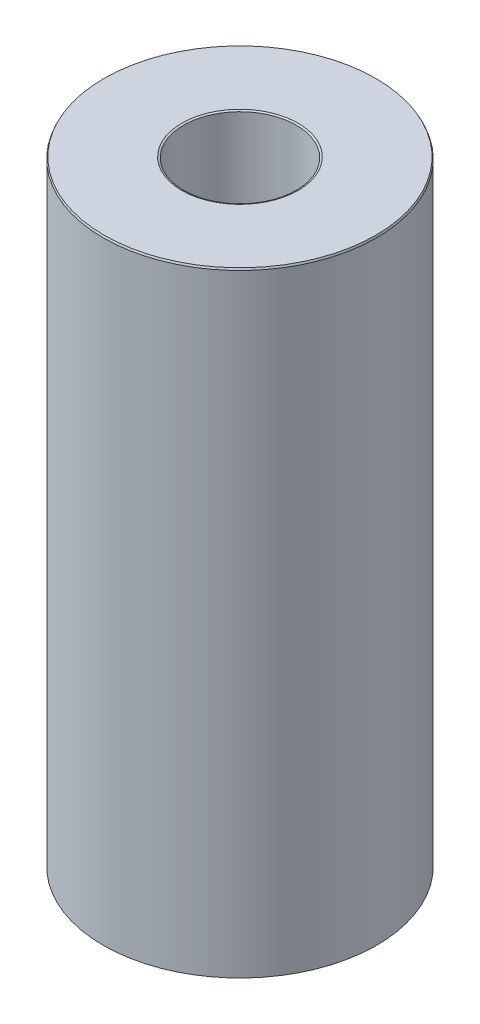
ISO-10303-21;
HEADER;
FILE_DESCRIPTION(('STEP AP214'),'2;1');
FILE_NAME('part.step','',(''),(''),'','','');
FILE_SCHEMA(('AUTOMOTIVE_DESIGN { 1 0 10303 214 1 1 1 1 }'));
ENDSEC;
DATA;
#1=APPLICATION_CONTEXT('core data for automotive mechanical design processes');
#2=APPLICATION_PROTOCOL_DEFINITION('international standard','automotive_design',2000,#1);
#3=PRODUCT_CONTEXT('',#1,'mechanical');
#4=PRODUCT('Part','Part','',(#3));
#5=PRODUCT_RELATED_PRODUCT_CATEGORY('part','',(#4));
#6=PRODUCT_DEFINITION_FORMATION('','',#4);
#7=PRODUCT_DEFINITION_CONTEXT('part definition',#1,'design');
#8=PRODUCT_DEFINITION('design','',#6,#7);
#9=PRODUCT_DEFINITION_SHAPE('','',#8);
#10=(LENGTH_UNIT() NAMED_UNIT(*) SI_UNIT(.MILLI.,.METRE.));
#11=(NAMED_UNIT(*) PLANE_ANGLE_UNIT() SI_UNIT($,.RADIAN.));
#12=(NAMED_UNIT(*) SI_UNIT($,.STERADIAN.) SOLID_ANGLE_UNIT());
#13=UNCERTAINTY_MEASURE_WITH_UNIT(LENGTH_MEASURE(1.E-05),#10,'distance_accuracy_value','');
#14=(GEOMETRIC_REPRESENTATION_CONTEXT(3) GLOBAL_UNCERTAINTY_ASSIGNED_CONTEXT((#13)) GLOBAL_UNIT_ASSIGNED_CONTEXT((#10,
#11,#12)) REPRESENTATION_CONTEXT('',''));
#15=CARTESIAN_POINT('',(0.,0.,0.));
#16=DIRECTION('',(0.,0.,1.));
#17=DIRECTION('',(1.,0.,0.));
#18=AXIS2_PLACEMENT_3D('',#15,#16,#17);
#19=CARTESIAN_POINT('',(0.,225.124120595034,0.));
#20=DIRECTION('',(0.,-1.,0.));
#21=DIRECTION('',(0.,0.,-1.));
#22=AXIS2_PLACEMENT_3D('',#19,#20,#21);
#23=CYLINDRICAL_SURFACE('',#22,50.);
#24=CARTESIAN_POINT('',(0.,0.297295181212298,0.));
#25=DIRECTION('',(0.,1.,0.));
#26=DIRECTION('',(0.,0.,1.));
#27=AXIS2_PLACEMENT_3D('',#24,#25,#26);
#28=CIRCLE('',#27,50.);
#29=CARTESIAN_POINT('',(0.,0.297295181212298,50.));
#30=VERTEX_POINT('',#29);
#31=EDGE_CURVE('E10',#30,#30,#28,.T.);
#32=ORIENTED_EDGE('',*,*,#31,.T.);
#33=EDGE_LOOP('',(#32));
#34=FACE_BOUND('',#33,.T.);
#35=CARTESIAN_POINT('',(0.,224.45630927449,0.));
#36=DIRECTION('',(0.,1.,0.));
#37=DIRECTION('',(0.,0.,1.));
#38=AXIS2_PLACEMENT_3D('',#35,#36,#37);
#39=CIRCLE('',#38,50.);
#40=CARTESIAN_POINT('',(0.,224.45630927449,50.));
#41=VERTEX_POINT('',#40);
#42=EDGE_CURVE('E50',#41,#41,#39,.F.);
#43=ORIENTED_EDGE('',*,*,#42,.T.);
#44=EDGE_LOOP('',(#43));
#45=FACE_BOUND('',#44,.T.);
#46=ADVANCED_FACE('F39',(#34,#45),#23,.T.);
#47=CARTESIAN_POINT('',(0.,225.124120595034,0.));
#48=DIRECTION('',(0.,1.,0.));
#49=DIRECTION('',(0.,0.,1.));
#50=AXIS2_PLACEMENT_3D('',#47,#48,#49);
#51=PLANE('',#50);
#52=CARTESIAN_POINT('',(0.,225.124120595034,0.));
#53=DIRECTION('',(0.,1.,0.));
#54=DIRECTION('',(0.,0.,1.));
#55=AXIS2_PLACEMENT_3D('',#52,#53,#54);
#56=CIRCLE('',#55,21.3043471888164);
#57=CARTESIAN_POINT('',(0.,225.124120595034,21.3043471888164));
#58=VERTEX_POINT('',#57);
#59=EDGE_CURVE('E58',#58,#58,#56,.F.);
#60=ORIENTED_EDGE('',*,*,#59,.T.);
#61=EDGE_LOOP('',(#60));
#62=FACE_BOUND('',#61,.T.);
#63=CARTESIAN_POINT('',(0.,225.124120595034,0.));
#64=DIRECTION('',(0.,1.,0.));
#65=DIRECTION('',(0.,0.,1.));
#66=AXIS2_PLACEMENT_3D('',#63,#64,#65);
#67=CIRCLE('',#66,49.7027048187878);
#68=CARTESIAN_POINT('',(0.,225.124120595034,49.7027048187878));
#69=VERTEX_POINT('',#68);
#70=EDGE_CURVE('E61',#69,#69,#67,.T.);
#71=ORIENTED_EDGE('',*,*,#70,.T.);
#72=EDGE_LOOP('',(#71));
#73=FACE_BOUND('',#72,.T.);
#74=ADVANCED_FACE('F88',(#62,#73),#51,.T.);
#75=CARTESIAN_POINT('',(0.,0.,0.));
#76=DIRECTION('',(0.,1.,0.));
#77=DIRECTION('',(0.,0.,1.));
#78=AXIS2_PLACEMENT_3D('',#75,#76,#77);
#79=PLANE('',#78);
#80=CARTESIAN_POINT('',(0.,0.,0.));
#81=DIRECTION('',(0.,1.,0.));
#82=DIRECTION('',(0.,0.,1.));
#83=AXIS2_PLACEMENT_3D('',#80,#81,#82);
#84=CIRCLE('',#83,20.9338310494844);
#85=CARTESIAN_POINT('',(0.,0.,20.9338310494844));
#86=VERTEX_POINT('',#85);
#87=EDGE_CURVE('E51',#86,#86,#84,.T.);
#88=ORIENTED_EDGE('',*,*,#87,.T.);
#89=EDGE_LOOP('',(#88));
#90=FACE_BOUND('',#89,.T.);
#91=CARTESIAN_POINT('',(0.,0.,0.));
#92=DIRECTION('',(0.,1.,0.));
#93=DIRECTION('',(0.,0.,1.));
#94=AXIS2_PLACEMENT_3D('',#91,#92,#93);
#95=CIRCLE('',#94,49.3321886794556);
#96=CARTESIAN_POINT('',(0.,0.,49.3321886794556));
#97=VERTEX_POINT('',#96);
#98=EDGE_CURVE('E54',#97,#97,#95,.F.);
#99=ORIENTED_EDGE('',*,*,#98,.T.);
#100=EDGE_LOOP('',(#99));
#101=FACE_BOUND('',#100,.T.);
#102=ADVANCED_FACE('F83',(#90,#101),#79,.F.);
#103=CARTESIAN_POINT('',(0.,225.124120595034,0.));
#104=DIRECTION('',(0.,-1.,0.));
#105=DIRECTION('',(0.,0.,-1.));
#106=AXIS2_PLACEMENT_3D('',#103,#104,#105);
#107=CYLINDRICAL_SURFACE('',#106,20.6365358682721);
#108=CARTESIAN_POINT('',(0.,224.826825413822,0.));
#109=DIRECTION('',(0.,1.,0.));
#110=DIRECTION('',(0.,0.,1.));
#111=AXIS2_PLACEMENT_3D('',#108,#109,#110);
#112=CIRCLE('',#111,20.6365358682721);
#113=CARTESIAN_POINT('',(0.,224.826825413822,20.6365358682721));
#114=VERTEX_POINT('',#113);
#115=EDGE_CURVE('E67',#114,#114,#112,.T.);
#116=ORIENTED_EDGE('',*,*,#115,.T.);
#117=EDGE_LOOP('',(#116));
#118=FACE_BOUND('',#117,.T.);
#119=CARTESIAN_POINT('',(0.,0.667811320544442,0.));
#120=DIRECTION('',(0.,1.,0.));
#121=DIRECTION('',(0.,0.,1.));
#122=AXIS2_PLACEMENT_3D('',#119,#120,#121);
#123=CIRCLE('',#122,20.6365358682721);
#124=CARTESIAN_POINT('',(0.,0.667811320544442,20.6365358682721));
#125=VERTEX_POINT('',#124);
#126=EDGE_CURVE('E69',#125,#125,#123,.F.);
#127=ORIENTED_EDGE('',*,*,#126,.T.);
#128=EDGE_LOOP('',(#127));
#129=FACE_BOUND('',#128,.T.);
#130=ADVANCED_FACE('F71',(#118,#129),#107,.F.);
#131=CARTESIAN_POINT('',(0.,224.826825413822,0.));
#132=DIRECTION('',(0.,1.,0.));
#133=DIRECTION('',(0.,0.,1.));
#134=AXIS2_PLACEMENT_3D('',#131,#132,#133);
#135=CONICAL_SURFACE('',#134,20.6365358682721,1.15195926593762);
#136=ORIENTED_EDGE('',*,*,#59,.F.);
#137=EDGE_LOOP('',(#136));
#138=FACE_BOUND('',#137,.T.);
#139=ORIENTED_EDGE('',*,*,#115,.F.);
#140=EDGE_LOOP('',(#139));
#141=FACE_BOUND('',#140,.T.);
#142=ADVANCED_FACE('F77',(#138,#141),#135,.F.);
#143=CARTESIAN_POINT('',(0.,0.,0.));
#144=DIRECTION('',(0.,-1.,0.));
#145=DIRECTION('',(0.,0.,-1.));
#146=AXIS2_PLACEMENT_3D('',#143,#144,#145);
#147=CONICAL_SURFACE('',#146,20.9338310494844,0.418837060857294);
#148=ORIENTED_EDGE('',*,*,#126,.F.);
#149=EDGE_LOOP('',(#148));
#150=FACE_BOUND('',#149,.T.);
#151=ORIENTED_EDGE('',*,*,#87,.F.);
#152=EDGE_LOOP('',(#151));
#153=FACE_BOUND('',#152,.T.);
#154=ADVANCED_FACE('F73',(#150,#153),#147,.F.);
#155=CARTESIAN_POINT('',(0.,0.297295181212298,0.));
#156=DIRECTION('',(0.,1.,0.));
#157=DIRECTION('',(0.,0.,1.));
#158=AXIS2_PLACEMENT_3D('',#155,#156,#157);
#159=CONICAL_SURFACE('',#158,50.,1.15195926593758);
#160=ORIENTED_EDGE('',*,*,#98,.F.);
#161=EDGE_LOOP('',(#160));
#162=FACE_BOUND('',#161,.T.);
#163=ORIENTED_EDGE('',*,*,#31,.F.);
#164=EDGE_LOOP('',(#163));
#165=FACE_BOUND('',#164,.T.);
#166=ADVANCED_FACE('F76',(#162,#165),#159,.T.);
#167=CARTESIAN_POINT('',(0.,225.124120595034,0.));
#168=DIRECTION('',(0.,-1.,0.));
#169=DIRECTION('',(0.,0.,-1.));
#170=AXIS2_PLACEMENT_3D('',#167,#168,#169);
#171=CONICAL_SURFACE('',#170,49.7027048187878,0.41883706085729);
#172=ORIENTED_EDGE('',*,*,#42,.F.);
#173=EDGE_LOOP('',(#172));
#174=FACE_BOUND('',#173,.T.);
#175=ORIENTED_EDGE('',*,*,#70,.F.);
#176=EDGE_LOOP('',(#175));
#177=FACE_BOUND('',#176,.T.);
#178=ADVANCED_FACE('F45',(#174,#177),#171,.T.);
#179=CLOSED_SHELL('',(#46,#74,#102,#130,#142,#154,#166,#178));
#180=MANIFOLD_SOLID_BREP('B2',#179);
#181=ADVANCED_BREP_SHAPE_REPRESENTATION('',(#18,#180),#14);
#182=SHAPE_DEFINITION_REPRESENTATION(#9,#181);
ENDSEC;
END-ISO-10303-21;
